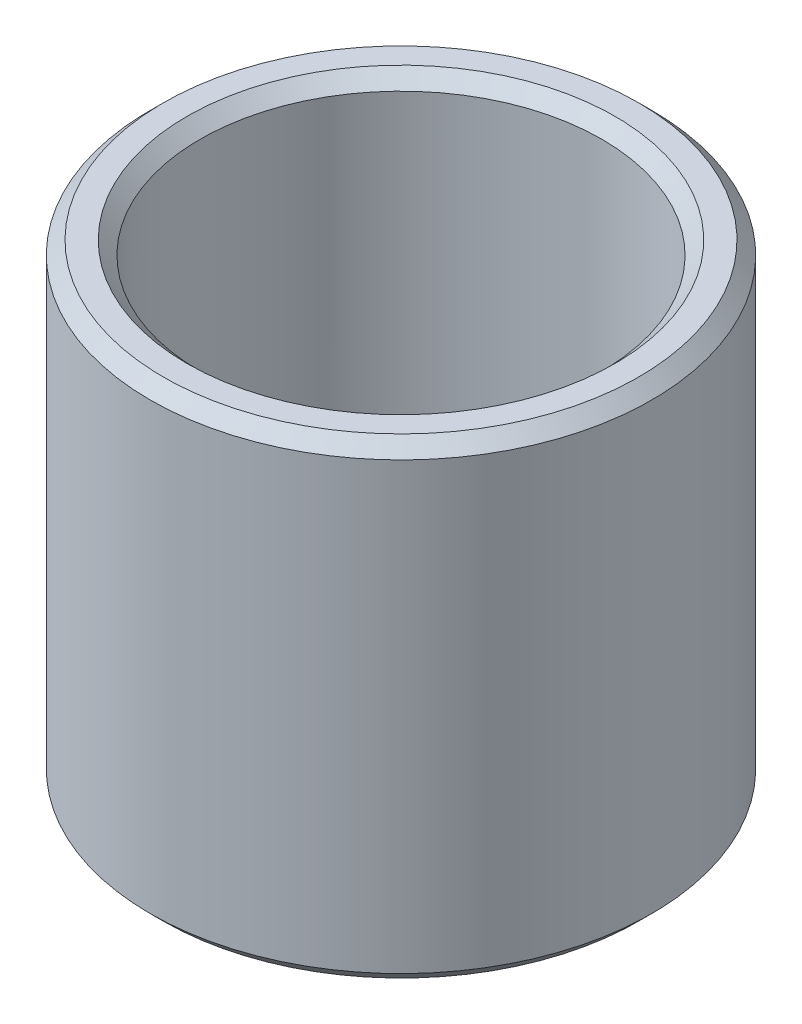
ISO-10303-21;
HEADER;
FILE_DESCRIPTION(('STEP AP214'),'2;1');
FILE_NAME('part.step','',(''),(''),'','','');
FILE_SCHEMA(('AUTOMOTIVE_DESIGN { 1 0 10303 214 1 1 1 1 }'));
ENDSEC;
DATA;
#1=APPLICATION_CONTEXT('core data for automotive mechanical design processes');
#2=APPLICATION_PROTOCOL_DEFINITION('international standard','automotive_design',2000,#1);
#3=PRODUCT_CONTEXT('',#1,'mechanical');
#4=PRODUCT('Part','Part','',(#3));
#5=PRODUCT_RELATED_PRODUCT_CATEGORY('part','',(#4));
#6=PRODUCT_DEFINITION_FORMATION('','',#4);
#7=PRODUCT_DEFINITION_CONTEXT('part definition',#1,'design');
#8=PRODUCT_DEFINITION('design','',#6,#7);
#9=PRODUCT_DEFINITION_SHAPE('','',#8);
#10=(LENGTH_UNIT() NAMED_UNIT(*) SI_UNIT(.MILLI.,.METRE.));
#11=(NAMED_UNIT(*) PLANE_ANGLE_UNIT() SI_UNIT($,.RADIAN.));
#12=(NAMED_UNIT(*) SI_UNIT($,.STERADIAN.) SOLID_ANGLE_UNIT());
#13=UNCERTAINTY_MEASURE_WITH_UNIT(LENGTH_MEASURE(1.E-05),#10,'distance_accuracy_value','');
#14=(GEOMETRIC_REPRESENTATION_CONTEXT(3) GLOBAL_UNCERTAINTY_ASSIGNED_CONTEXT((#13)) GLOBAL_UNIT_ASSIGNED_CONTEXT((#10,
#11,#12)) REPRESENTATION_CONTEXT('',''));
#15=CARTESIAN_POINT('',(0.,0.,0.));
#16=DIRECTION('',(0.,0.,1.));
#17=DIRECTION('',(1.,0.,0.));
#18=AXIS2_PLACEMENT_3D('',#15,#16,#17);
#19=CARTESIAN_POINT('',(0.,112.732452654063,0.));
#20=DIRECTION('',(0.,-1.,0.));
#21=DIRECTION('',(0.,0.,-1.));
#22=AXIS2_PLACEMENT_3D('',#19,#20,#21);
#23=CYLINDRICAL_SURFACE('',#22,60.);
#24=CARTESIAN_POINT('',(0.,3.15944356942435,0.));
#25=DIRECTION('',(0.,1.,0.));
#26=DIRECTION('',(0.,0.,1.));
#27=AXIS2_PLACEMENT_3D('',#24,#25,#26);
#28=CIRCLE('',#27,60.);
#29=CARTESIAN_POINT('',(0.,3.15944356942435,60.));
#30=VERTEX_POINT('',#29);
#31=EDGE_CURVE('E10',#30,#30,#28,.T.);
#32=ORIENTED_EDGE('',*,*,#31,.T.);
#33=EDGE_LOOP('',(#32));
#34=FACE_BOUND('',#33,.T.);
#35=CARTESIAN_POINT('',(0.,109.573009084639,0.));
#36=DIRECTION('',(0.,1.,0.));
#37=DIRECTION('',(0.,0.,1.));
#38=AXIS2_PLACEMENT_3D('',#35,#36,#37);
#39=CIRCLE('',#38,60.);
#40=CARTESIAN_POINT('',(0.,109.573009084639,-60.));
#41=VERTEX_POINT('',#40);
#42=EDGE_CURVE('E50',#41,#41,#39,.F.);
#43=ORIENTED_EDGE('',*,*,#42,.T.);
#44=EDGE_LOOP('',(#43));
#45=FACE_BOUND('',#44,.T.);
#46=ADVANCED_FACE('F39',(#34,#45),#23,.T.);
#47=CARTESIAN_POINT('',(0.,112.732452654063,0.));
#48=DIRECTION('',(0.,1.,0.));
#49=DIRECTION('',(0.,0.,1.));
#50=AXIS2_PLACEMENT_3D('',#47,#48,#49);
#51=PLANE('',#50);
#52=CARTESIAN_POINT('',(0.,112.732452654063,0.));
#53=DIRECTION('',(0.,1.,0.));
#54=DIRECTION('',(0.,0.,1.));
#55=AXIS2_PLACEMENT_3D('',#52,#53,#54);
#56=CIRCLE('',#55,51.2137768581418);
#57=CARTESIAN_POINT('',(0.,112.732452654063,51.2137768581418));
#58=VERTEX_POINT('',#57);
#59=EDGE_CURVE('E58',#58,#58,#56,.F.);
#60=ORIENTED_EDGE('',*,*,#59,.T.);
#61=EDGE_LOOP('',(#60));
#62=FACE_BOUND('',#61,.T.);
#63=CARTESIAN_POINT('',(0.,112.732452654063,0.));
#64=DIRECTION('',(0.,1.,0.));
#65=DIRECTION('',(0.,0.,1.));
#66=AXIS2_PLACEMENT_3D('',#63,#64,#65);
#67=CIRCLE('',#66,56.8405564305756);
#68=CARTESIAN_POINT('',(0.,112.732452654063,-56.8405564305756));
#69=VERTEX_POINT('',#68);
#70=EDGE_CURVE('E61',#69,#69,#67,.T.);
#71=ORIENTED_EDGE('',*,*,#70,.T.);
#72=EDGE_LOOP('',(#71));
#73=FACE_BOUND('',#72,.T.);
#74=ADVANCED_FACE('F88',(#62,#73),#51,.T.);
#75=CARTESIAN_POINT('',(0.,0.,0.));
#76=DIRECTION('',(0.,1.,0.));
#77=DIRECTION('',(0.,0.,1.));
#78=AXIS2_PLACEMENT_3D('',#75,#76,#77);
#79=PLANE('',#78);
#80=CARTESIAN_POINT('',(0.,0.,0.));
#81=DIRECTION('',(0.,1.,0.));
#82=DIRECTION('',(0.,0.,1.));
#83=AXIS2_PLACEMENT_3D('',#80,#81,#82);
#84=CIRCLE('',#83,51.2137768581418);
#85=CARTESIAN_POINT('',(0.,0.,-51.2137768581418));
#86=VERTEX_POINT('',#85);
#87=EDGE_CURVE('E51',#86,#86,#84,.T.);
#88=ORIENTED_EDGE('',*,*,#87,.T.);
#89=EDGE_LOOP('',(#88));
#90=FACE_BOUND('',#89,.T.);
#91=CARTESIAN_POINT('',(0.,0.,0.));
#92=DIRECTION('',(0.,1.,0.));
#93=DIRECTION('',(0.,0.,1.));
#94=AXIS2_PLACEMENT_3D('',#91,#92,#93);
#95=CIRCLE('',#94,56.8405564305756);
#96=CARTESIAN_POINT('',(0.,0.,56.8405564305756));
#97=VERTEX_POINT('',#96);
#98=EDGE_CURVE('E54',#97,#97,#95,.F.);
#99=ORIENTED_EDGE('',*,*,#98,.T.);
#100=EDGE_LOOP('',(#99));
#101=FACE_BOUND('',#100,.T.);
#102=ADVANCED_FACE('F83',(#90,#101),#79,.F.);
#103=CARTESIAN_POINT('',(0.,112.732452654063,0.));
#104=DIRECTION('',(0.,-1.,0.));
#105=DIRECTION('',(0.,0.,-1.));
#106=AXIS2_PLACEMENT_3D('',#103,#104,#105);
#107=CYLINDRICAL_SURFACE('',#106,48.0543332887174);
#108=CARTESIAN_POINT('',(0.,109.573009084639,0.));
#109=DIRECTION('',(0.,1.,0.));
#110=DIRECTION('',(0.,0.,1.));
#111=AXIS2_PLACEMENT_3D('',#108,#109,#110);
#112=CIRCLE('',#111,48.0543332887174);
#113=CARTESIAN_POINT('',(0.,109.573009084639,-48.0543332887174));
#114=VERTEX_POINT('',#113);
#115=EDGE_CURVE('E67',#114,#114,#112,.T.);
#116=CARTESIAN_POINT('',(0.,3.15944356942444,0.));
#117=DIRECTION('',(0.,1.,0.));
#118=DIRECTION('',(0.,0.,1.));
#119=AXIS2_PLACEMENT_3D('',#116,#117,#118);
#120=CIRCLE('',#119,48.0543332887174);
#121=CARTESIAN_POINT('',(0.,3.15944356942444,-48.0543332887174));
#122=VERTEX_POINT('',#121);
#123=EDGE_CURVE('E69',#122,#122,#120,.F.);
#124=CARTESIAN_POINT('',(0.,109.573009084639,-48.0543332887174));
#125=CARTESIAN_POINT('',(0.,108.464534443856,-48.0543332887174));
#126=CARTESIAN_POINT('',(0.,107.356059803072,-48.0543332887174));
#127=CARTESIAN_POINT('',(0.,105.139110521505,-48.0543332887174));
#128=CARTESIAN_POINT('',(0.,104.030635880722,-48.0543332887174));
#129=CARTESIAN_POINT('',(0.,101.813686599155,-48.0543332887174));
#130=CARTESIAN_POINT('',(0.,100.705211958371,-48.0543332887174));
#131=CARTESIAN_POINT('',(0.,98.4882626768042,-48.0543332887174));
#132=CARTESIAN_POINT('',(0.,97.3797880360207,-48.0543332887174));
#133=CARTESIAN_POINT('',(0.,95.1628387544537,-48.0543332887174));
#134=CARTESIAN_POINT('',(0.,94.0543641136702,-48.0543332887174));
#135=CARTESIAN_POINT('',(0.,91.8374148321033,-48.0543332887174));
#136=CARTESIAN_POINT('',(0.,90.7289401913198,-48.0543332887174));
#137=CARTESIAN_POINT('',(0.,88.5119909097528,-48.0543332887174));
#138=CARTESIAN_POINT('',(0.,87.4035162689693,-48.0543332887174));
#139=CARTESIAN_POINT('',(0.,85.1865669874024,-48.0543332887174));
#140=CARTESIAN_POINT('',(0.,84.0780923466189,-48.0543332887174));
#141=CARTESIAN_POINT('',(0.,81.8611430650519,-48.0543332887174));
#142=CARTESIAN_POINT('',(0.,80.7526684242684,-48.0543332887174));
#143=CARTESIAN_POINT('',(0.,78.5357191427015,-48.0543332887174));
#144=CARTESIAN_POINT('',(0.,77.427244501918,-48.0543332887174));
#145=CARTESIAN_POINT('',(0.,75.210295220351,-48.0543332887174));
#146=CARTESIAN_POINT('',(0.,74.1018205795675,-48.0543332887174));
#147=CARTESIAN_POINT('',(0.,71.8848712980005,-48.0543332887174));
#148=CARTESIAN_POINT('',(0.,70.776396657217,-48.0543332887174));
#149=CARTESIAN_POINT('',(0.,68.5594473756501,-48.0543332887174));
#150=CARTESIAN_POINT('',(0.,67.4509727348666,-48.0543332887174));
#151=CARTESIAN_POINT('',(0.,65.2340234532996,-48.0543332887174));
#152=CARTESIAN_POINT('',(0.,64.1255488125161,-48.0543332887174));
#153=CARTESIAN_POINT('',(0.,61.9085995309492,-48.0543332887174));
#154=CARTESIAN_POINT('',(0.,60.8001248901657,-48.0543332887174));
#155=CARTESIAN_POINT('',(0.,58.5831756085987,-48.0543332887174));
#156=CARTESIAN_POINT('',(0.,57.4747009678152,-48.0543332887174));
#157=CARTESIAN_POINT('',(0.,55.2577516862482,-48.0543332887174));
#158=CARTESIAN_POINT('',(0.,54.1492770454648,-48.0543332887174));
#159=CARTESIAN_POINT('',(0.,51.9323277638978,-48.0543332887174));
#160=CARTESIAN_POINT('',(0.,50.8238531231143,-48.0543332887174));
#161=CARTESIAN_POINT('',(0.,48.6069038415473,-48.0543332887174));
#162=CARTESIAN_POINT('',(0.,47.4984292007638,-48.0543332887174));
#163=CARTESIAN_POINT('',(0.,45.2814799191969,-48.0543332887174));
#164=CARTESIAN_POINT('',(0.,44.1730052784134,-48.0543332887174));
#165=CARTESIAN_POINT('',(0.,41.9560559968464,-48.0543332887174));
#166=CARTESIAN_POINT('',(0.,40.8475813560629,-48.0543332887174));
#167=CARTESIAN_POINT('',(0.,38.630632074496,-48.0543332887174));
#168=CARTESIAN_POINT('',(0.,37.5221574337125,-48.0543332887174));
#169=CARTESIAN_POINT('',(0.,35.3052081521455,-48.0543332887174));
#170=CARTESIAN_POINT('',(0.,34.196733511362,-48.0543332887174));
#171=CARTESIAN_POINT('',(0.,31.9797842297951,-48.0543332887174));
#172=CARTESIAN_POINT('',(0.,30.8713095890116,-48.0543332887174));
#173=CARTESIAN_POINT('',(0.,28.6543603074446,-48.0543332887174));
#174=CARTESIAN_POINT('',(0.,27.5458856666611,-48.0543332887174));
#175=CARTESIAN_POINT('',(0.,25.3289363850941,-48.0543332887174));
#176=CARTESIAN_POINT('',(0.,24.2204617443107,-48.0543332887174));
#177=CARTESIAN_POINT('',(0.,22.0035124627437,-48.0543332887174));
#178=CARTESIAN_POINT('',(0.,20.8950378219602,-48.0543332887174));
#179=CARTESIAN_POINT('',(0.,18.6780885403932,-48.0543332887174));
#180=CARTESIAN_POINT('',(0.,17.5696138996097,-48.0543332887174));
#181=CARTESIAN_POINT('',(0.,15.3526646180428,-48.0543332887174));
#182=CARTESIAN_POINT('',(0.,14.2441899772593,-48.0543332887174));
#183=CARTESIAN_POINT('',(0.,12.0272406956923,-48.0543332887174));
#184=CARTESIAN_POINT('',(0.,10.9187660549088,-48.0543332887174));
#185=CARTESIAN_POINT('',(0.,8.70181677334186,-48.0543332887174));
#186=CARTESIAN_POINT('',(0.,7.59334213255837,-48.0543332887174));
#187=CARTESIAN_POINT('',(0.,5.3763928509914,-48.0543332887174));
#188=CARTESIAN_POINT('',(0.,4.26791821020791,-48.0543332887174));
#189=CARTESIAN_POINT('',(0.,3.15944356942444,-48.0543332887174));
#190=B_SPLINE_CURVE_WITH_KNOTS('',3,(#124,#125,#126,#127,#128,#129,#130,#131,#132,#133,#134,
#135,#136,#137,#138,#139,#140,#141,#142,#143,#144,#145,#146,#147,#148,#149,#150,#151,#152,#153,
#154,#155,#156,#157,#158,#159,#160,#161,#162,#163,#164,#165,#166,#167,#168,#169,#170,#171,#172,
#173,#174,#175,#176,#177,#178,#179,#180,#181,#182,#183,#184,#185,#186,#187,#188,#189),
.UNSPECIFIED.,.F.,.F.,(4,2,2,2,2,2,2,2,2,2,2,2,2,2,2,2,2,2,2,2,2,2,2,2,2,2,2,2,2,2,2,2,4),(0.,
3.32542392235047,6.65084784470092,9.97627176705138,13.3016956894018,16.6271196117523,
19.9525435341028,23.2779674564532,26.6033913788037,29.9288153011541,33.2542392235046,
36.579663145855,39.9050870682055,43.2305109905559,46.5559349129064,49.8813588352569,
53.2067827576073,56.5322066799578,59.8576306023082,63.1830545246587,66.5084784470091,
69.8339023693596,73.15932629171,76.4847502140605,79.810174136411,83.1355980587614,
86.4610219811119,89.7864459034623,93.1118698258128,96.4372937481632,99.7627176705137,
103.088141592864,106.413565515215),.UNSPECIFIED.);
#191=EDGE_CURVE('BSEAM71',#114,#122,#190,.T.);
#192=ORIENTED_EDGE('',*,*,#115,.T.);
#193=ORIENTED_EDGE('',*,*,#123,.T.);
#194=ORIENTED_EDGE('',*,*,#191,.T.);
#195=ORIENTED_EDGE('',*,*,#191,.F.);
#196=EDGE_LOOP('',(#192,#194,#193,#195));
#197=FACE_BOUND('',#196,.T.);
#198=ADVANCED_FACE('F71',(#197),#107,.F.);
#199=CARTESIAN_POINT('',(0.,109.573009084639,0.));
#200=DIRECTION('',(0.,1.,0.));
#201=DIRECTION('',(0.,0.,1.));
#202=AXIS2_PLACEMENT_3D('',#199,#200,#201);
#203=CONICAL_SURFACE('',#202,48.0543332887174,0.785398163397454);
#204=ORIENTED_EDGE('',*,*,#59,.F.);
#205=EDGE_LOOP('',(#204));
#206=FACE_BOUND('',#205,.T.);
#207=ORIENTED_EDGE('',*,*,#115,.F.);
#208=EDGE_LOOP('',(#207));
#209=FACE_BOUND('',#208,.T.);
#210=ADVANCED_FACE('F77',(#206,#209),#203,.F.);
#211=CARTESIAN_POINT('',(0.,0.,0.));
#212=DIRECTION('',(0.,-1.,0.));
#213=DIRECTION('',(0.,0.,-1.));
#214=AXIS2_PLACEMENT_3D('',#211,#212,#213);
#215=CONICAL_SURFACE('',#214,51.2137768581418,0.785398163397447);
#216=CARTESIAN_POINT('',(0.,3.15944356942444,-48.0543332887174));
#217=CARTESIAN_POINT('',(0.,3.1265326989096,-48.0872441592322));
#218=CARTESIAN_POINT('',(0.,3.09362182839476,-48.1201550297471));
#219=CARTESIAN_POINT('',(0.,3.02780008736508,-48.1859767707767));
#220=CARTESIAN_POINT('',(0.,2.99488921685025,-48.2188876412916));
#221=CARTESIAN_POINT('',(0.,2.92906747582057,-48.2847093823213));
#222=CARTESIAN_POINT('',(0.,2.89615660530573,-48.3176202528361));
#223=CARTESIAN_POINT('',(0.,2.83033486427606,-48.3834419938658));
#224=CARTESIAN_POINT('',(0.,2.79742399376122,-48.4163528643806));
#225=CARTESIAN_POINT('',(0.,2.73160225273154,-48.4821746054103));
#226=CARTESIAN_POINT('',(0.,2.69869138221671,-48.5150854759251));
#227=CARTESIAN_POINT('',(0.,2.63286964118703,-48.5809072169548));
#228=CARTESIAN_POINT('',(0.,2.59995877067219,-48.6138180874696));
#229=CARTESIAN_POINT('',(0.,2.53413702964252,-48.6796398284993));
#230=CARTESIAN_POINT('',(0.,2.50122615912768,-48.7125506990141));
#231=CARTESIAN_POINT('',(0.,2.435404418098,-48.7783724400438));
#232=CARTESIAN_POINT('',(0.,2.40249354758316,-48.8112833105587));
#233=CARTESIAN_POINT('',(0.,2.33667180655349,-48.8771050515883));
#234=CARTESIAN_POINT('',(0.,2.30376093603865,-48.9100159221032));
#235=CARTESIAN_POINT('',(0.,2.23793919500898,-48.9758376631329));
#236=CARTESIAN_POINT('',(0.,2.20502832449414,-49.0087485336477));
#237=CARTESIAN_POINT('',(0.,2.13920658346446,-49.0745702746774));
#238=CARTESIAN_POINT('',(0.,2.10629571294962,-49.1074811451922));
#239=CARTESIAN_POINT('',(0.,2.04047397191995,-49.1733028862219));
#240=CARTESIAN_POINT('',(0.,2.00756310140511,-49.2062137567367));
#241=CARTESIAN_POINT('',(0.,1.94174136037543,-49.2720354977664));
#242=CARTESIAN_POINT('',(0.,1.9088304898606,-49.3049463682812));
#243=CARTESIAN_POINT('',(0.,1.84300874883092,-49.3707681093109));
#244=CARTESIAN_POINT('',(0.,1.81009787831608,-49.4036789798257));
#245=CARTESIAN_POINT('',(0.,1.74427613728641,-49.4695007208554));
#246=CARTESIAN_POINT('',(0.,1.71136526677157,-49.5024115913703));
#247=CARTESIAN_POINT('',(0.,1.64554352574189,-49.5682333323999));
#248=CARTESIAN_POINT('',(0.,1.61263265522706,-49.6011442029148));
#249=CARTESIAN_POINT('',(0.,1.54681091419738,-49.6669659439444));
#250=CARTESIAN_POINT('',(0.,1.51390004368254,-49.6998768144593));
#251=CARTESIAN_POINT('',(0.,1.44807830265287,-49.765698555489));
#252=CARTESIAN_POINT('',(0.,1.41516743213803,-49.7986094260038));
#253=CARTESIAN_POINT('',(0.,1.34934569110835,-49.8644311670335));
#254=CARTESIAN_POINT('',(0.,1.31643482059351,-49.8973420375483));
#255=CARTESIAN_POINT('',(0.,1.25061307956384,-49.963163778578));
#256=CARTESIAN_POINT('',(0.,1.217702209049,-49.9960746490928));
#257=CARTESIAN_POINT('',(0.,1.15188046801933,-50.0618963901225));
#258=CARTESIAN_POINT('',(0.,1.11896959750449,-50.0948072606373));
#259=CARTESIAN_POINT('',(0.,1.05314785647481,-50.160629001667));
#260=CARTESIAN_POINT('',(0.,1.02023698595997,-50.1935398721818));
#261=CARTESIAN_POINT('',(0.,0.954415244930298,-50.2593616132115));
#262=CARTESIAN_POINT('',(0.,0.92150437441546,-50.2922724837264));
#263=CARTESIAN_POINT('',(0.,0.855682633385785,-50.358094224756));
#264=CARTESIAN_POINT('',(0.,0.822771762870947,-50.3910050952709));
#265=CARTESIAN_POINT('',(0.,0.756950021841271,-50.4568268363005));
#266=CARTESIAN_POINT('',(0.,0.724039151326433,-50.4897377068154));
#267=CARTESIAN_POINT('',(0.,0.658217410296757,-50.5555594478451));
#268=CARTESIAN_POINT('',(0.,0.62530653978192,-50.5884703183599));
#269=CARTESIAN_POINT('',(0.,0.559484798752244,-50.6542920593896));
#270=CARTESIAN_POINT('',(0.,0.526573928237406,-50.6872029299044));
#271=CARTESIAN_POINT('',(0.,0.46075218720773,-50.7530246709341));
#272=CARTESIAN_POINT('',(0.,0.427841316692892,-50.7859355414489));
#273=CARTESIAN_POINT('',(0.,0.362019575663217,-50.8517572824786));
#274=CARTESIAN_POINT('',(0.,0.329108705148379,-50.8846681529934));
#275=CARTESIAN_POINT('',(0.,0.263286964118703,-50.9504898940231));
#276=CARTESIAN_POINT('',(0.,0.230376093603865,-50.983400764538));
#277=CARTESIAN_POINT('',(0.,0.164554352574189,-51.0492225055676));
#278=CARTESIAN_POINT('',(0.,0.131643482059352,-51.0821333760825));
#279=CARTESIAN_POINT('',(0.,0.0658217410296757,-51.1479551171121));
#280=CARTESIAN_POINT('',(0.,0.0329108705148379,-51.180865987627));
#281=CARTESIAN_POINT('',(0.,0.,-51.2137768581418));
#282=B_SPLINE_CURVE_WITH_KNOTS('',3,(#216,#217,#218,#219,#220,#221,#222,#223,#224,#225,#226,
#227,#228,#229,#230,#231,#232,#233,#234,#235,#236,#237,#238,#239,#240,#241,#242,#243,#244,#245,
#246,#247,#248,#249,#250,#251,#252,#253,#254,#255,#256,#257,#258,#259,#260,#261,#262,#263,#264,
#265,#266,#267,#268,#269,#270,#271,#272,#273,#274,#275,#276,#277,#278,#279,#280,#281),
.UNSPECIFIED.,.F.,.F.,(4,2,2,2,2,2,2,2,2,2,2,2,2,2,2,2,2,2,2,2,2,2,2,2,2,2,2,2,2,2,2,2,4),(0.,
0.139628998294766,0.279257996589531,0.418886994884297,0.558515993179062,0.698144991473828,
0.837773989768593,0.977402988063359,1.11703198635812,1.25666098465289,1.39628998294766,
1.53591898124242,1.67554797953719,1.81517697783195,1.95480597612672,2.09443497442148,
2.23406397271625,2.37369297101101,2.51332196930578,2.65295096760054,2.79257996589531,
2.93220896419007,3.07183796248484,3.2114669607796,3.35109595907437,3.49072495736913,
3.6303539556639,3.76998295395867,3.90961195225343,4.0492409505482,4.18886994884296,
4.32849894713773,4.46812794543249),.UNSPECIFIED.);
#283=EDGE_CURVE('BSEAM73',#122,#86,#282,.T.);
#284=ORIENTED_EDGE('',*,*,#123,.F.);
#285=ORIENTED_EDGE('',*,*,#87,.F.);
#286=ORIENTED_EDGE('',*,*,#283,.T.);
#287=ORIENTED_EDGE('',*,*,#283,.F.);
#288=EDGE_LOOP('',(#284,#286,#285,#287));
#289=FACE_BOUND('',#288,.T.);
#290=ADVANCED_FACE('F73',(#289),#215,.F.);
#291=CARTESIAN_POINT('',(0.,3.15944356942435,0.));
#292=DIRECTION('',(0.,1.,0.));
#293=DIRECTION('',(0.,0.,1.));
#294=AXIS2_PLACEMENT_3D('',#291,#292,#293);
#295=CONICAL_SURFACE('',#294,60.,0.785398163397453);
#296=ORIENTED_EDGE('',*,*,#98,.F.);
#297=EDGE_LOOP('',(#296));
#298=FACE_BOUND('',#297,.T.);
#299=ORIENTED_EDGE('',*,*,#31,.F.);
#300=EDGE_LOOP('',(#299));
#301=FACE_BOUND('',#300,.T.);
#302=ADVANCED_FACE('F76',(#298,#301),#295,.T.);
#303=CARTESIAN_POINT('',(0.,112.732452654063,0.));
#304=DIRECTION('',(0.,-1.,0.));
#305=DIRECTION('',(0.,0.,-1.));
#306=AXIS2_PLACEMENT_3D('',#303,#304,#305);
#307=CONICAL_SURFACE('',#306,56.8405564305756,0.785398163397448);
#308=CARTESIAN_POINT('',(0.,109.573009084639,-60.));
#309=CARTESIAN_POINT('',(0.,109.605919955154,-59.9670891294852));
#310=CARTESIAN_POINT('',(0.,109.638830825669,-59.9341782589703));
#311=CARTESIAN_POINT('',(0.,109.704652566698,-59.8683565179407));
#312=CARTESIAN_POINT('',(0.,109.737563437213,-59.8354456474258));
#313=CARTESIAN_POINT('',(0.,109.803385178243,-59.7696239063961));
#314=CARTESIAN_POINT('',(0.,109.836296048758,-59.7367130358813));
#315=CARTESIAN_POINT('',(0.,109.902117789787,-59.6708912948516));
#316=CARTESIAN_POINT('',(0.,109.935028660302,-59.6379804243368));
#317=CARTESIAN_POINT('',(0.,110.000850401332,-59.5721586833071));
#318=CARTESIAN_POINT('',(0.,110.033761271847,-59.5392478127923));
#319=CARTESIAN_POINT('',(0.,110.099583012876,-59.4734260717626));
#320=CARTESIAN_POINT('',(0.,110.132493883391,-59.4405152012478));
#321=CARTESIAN_POINT('',(0.,110.198315624421,-59.3746934602181));
#322=CARTESIAN_POINT('',(0.,110.231226494936,-59.3417825897033));
#323=CARTESIAN_POINT('',(0.,110.297048235965,-59.2759608486736));
#324=CARTESIAN_POINT('',(0.,110.32995910648,-59.2430499781587));
#325=CARTESIAN_POINT('',(0.,110.39578084751,-59.1772282371291));
#326=CARTESIAN_POINT('',(0.,110.428691718025,-59.1443173666142));
#327=CARTESIAN_POINT('',(0.,110.494513459054,-59.0784956255846));
#328=CARTESIAN_POINT('',(0.,110.527424329569,-59.0455847550697));
#329=CARTESIAN_POINT('',(0.,110.593246070599,-58.97976301404));
#330=CARTESIAN_POINT('',(0.,110.626156941114,-58.9468521435252));
#331=CARTESIAN_POINT('',(0.,110.691978682144,-58.8810304024955));
#332=CARTESIAN_POINT('',(0.,110.724889552658,-58.8481195319807));
#333=CARTESIAN_POINT('',(0.,110.790711293688,-58.782297790951));
#334=CARTESIAN_POINT('',(0.,110.823622164203,-58.7493869204362));
#335=CARTESIAN_POINT('',(0.,110.889443905233,-58.6835651794065));
#336=CARTESIAN_POINT('',(0.,110.922354775747,-58.6506543088917));
#337=CARTESIAN_POINT('',(0.,110.988176516777,-58.584832567862));
#338=CARTESIAN_POINT('',(0.,111.021087387292,-58.5519216973472));
#339=CARTESIAN_POINT('',(0.,111.086909128322,-58.4860999563175));
#340=CARTESIAN_POINT('',(0.,111.119819998836,-58.4531890858026));
#341=CARTESIAN_POINT('',(0.,111.185641739866,-58.387367344773));
#342=CARTESIAN_POINT('',(0.,111.218552610381,-58.3544564742581));
#343=CARTESIAN_POINT('',(0.,111.284374351411,-58.2886347332284));
#344=CARTESIAN_POINT('',(0.,111.317285221925,-58.2557238627136));
#345=CARTESIAN_POINT('',(0.,111.383106962955,-58.1899021216839));
#346=CARTESIAN_POINT('',(0.,111.41601783347,-58.1569912511691));
#347=CARTESIAN_POINT('',(0.,111.4818395745,-58.0911695101394));
#348=CARTESIAN_POINT('',(0.,111.514750445014,-58.0582586396246));
#349=CARTESIAN_POINT('',(0.,111.580572186044,-57.9924368985949));
#350=CARTESIAN_POINT('',(0.,111.613483056559,-57.9595260280801));
#351=CARTESIAN_POINT('',(0.,111.679304797589,-57.8937042870504));
#352=CARTESIAN_POINT('',(0.,111.712215668103,-57.8607934165356));
#353=CARTESIAN_POINT('',(0.,111.778037409133,-57.7949716755059));
#354=CARTESIAN_POINT('',(0.,111.810948279648,-57.7620608049911));
#355=CARTESIAN_POINT('',(0.,111.876770020678,-57.6962390639614));
#356=CARTESIAN_POINT('',(0.,111.909680891193,-57.6633281934465));
#357=CARTESIAN_POINT('',(0.,111.975502632222,-57.5975064524169));
#358=CARTESIAN_POINT('',(0.,112.008413502737,-57.564595581902));
#359=CARTESIAN_POINT('',(0.,112.074235243767,-57.4987738408723));
#360=CARTESIAN_POINT('',(0.,112.107146114282,-57.4658629703575));
#361=CARTESIAN_POINT('',(0.,112.172967855311,-57.4000412293278));
#362=CARTESIAN_POINT('',(0.,112.205878725826,-57.367130358813));
#363=CARTESIAN_POINT('',(0.,112.271700466856,-57.3013086177833));
#364=CARTESIAN_POINT('',(0.,112.304611337371,-57.2683977472685));
#365=CARTESIAN_POINT('',(0.,112.3704330784,-57.2025760062388));
#366=CARTESIAN_POINT('',(0.,112.403343948915,-57.169665135724));
#367=CARTESIAN_POINT('',(0.,112.469165689945,-57.1038433946943));
#368=CARTESIAN_POINT('',(0.,112.50207656046,-57.0709325241795));
#369=CARTESIAN_POINT('',(0.,112.567898301489,-57.0051107831498));
#370=CARTESIAN_POINT('',(0.,112.600809172004,-56.9721999126349));
#371=CARTESIAN_POINT('',(0.,112.666630913034,-56.9063781716053));
#372=CARTESIAN_POINT('',(0.,112.699541783549,-56.8734673010904));
#373=CARTESIAN_POINT('',(0.,112.732452654063,-56.8405564305756));
#374=B_SPLINE_CURVE_WITH_KNOTS('',3,(#308,#309,#310,#311,#312,#313,#314,#315,#316,#317,#318,
#319,#320,#321,#322,#323,#324,#325,#326,#327,#328,#329,#330,#331,#332,#333,#334,#335,#336,#337,
#338,#339,#340,#341,#342,#343,#344,#345,#346,#347,#348,#349,#350,#351,#352,#353,#354,#355,#356,
#357,#358,#359,#360,#361,#362,#363,#364,#365,#366,#367,#368,#369,#370,#371,#372,#373),
.UNSPECIFIED.,.F.,.F.,(4,2,2,2,2,2,2,2,2,2,2,2,2,2,2,2,2,2,2,2,2,2,2,2,2,2,2,2,2,2,2,2,4),(0.,
0.139628998294766,0.279257996589531,0.418886994884292,0.558515993179057,0.698144991473823,
0.837773989768589,0.977402988063354,1.11703198635812,1.25666098465289,1.39628998294765,
1.53591898124242,1.67554797953718,1.81517697783194,1.95480597612671,2.09443497442147,
2.23406397271623,2.373692971011,2.51332196930576,2.65295096760053,2.79257996589529,
2.93220896419005,3.07183796248482,3.21146696077958,3.35109595907435,3.49072495736912,
3.63035395566388,3.76998295395865,3.90961195225341,4.04924095054817,4.18886994884294,
4.3284989471377,4.46812794543247),.UNSPECIFIED.);
#375=EDGE_CURVE('BSEAM45',#41,#69,#374,.T.);
#376=ORIENTED_EDGE('',*,*,#42,.F.);
#377=ORIENTED_EDGE('',*,*,#70,.F.);
#378=ORIENTED_EDGE('',*,*,#375,.T.);
#379=ORIENTED_EDGE('',*,*,#375,.F.);
#380=EDGE_LOOP('',(#376,#378,#377,#379));
#381=FACE_BOUND('',#380,.T.);
#382=ADVANCED_FACE('F45',(#381),#307,.T.);
#383=CLOSED_SHELL('',(#46,#74,#102,#198,#210,#290,#302,#382));
#384=MANIFOLD_SOLID_BREP('B2',#383);
#385=ADVANCED_BREP_SHAPE_REPRESENTATION('',(#18,#384),#14);
#386=SHAPE_DEFINITION_REPRESENTATION(#9,#385);
ENDSEC;
END-ISO-10303-21;
